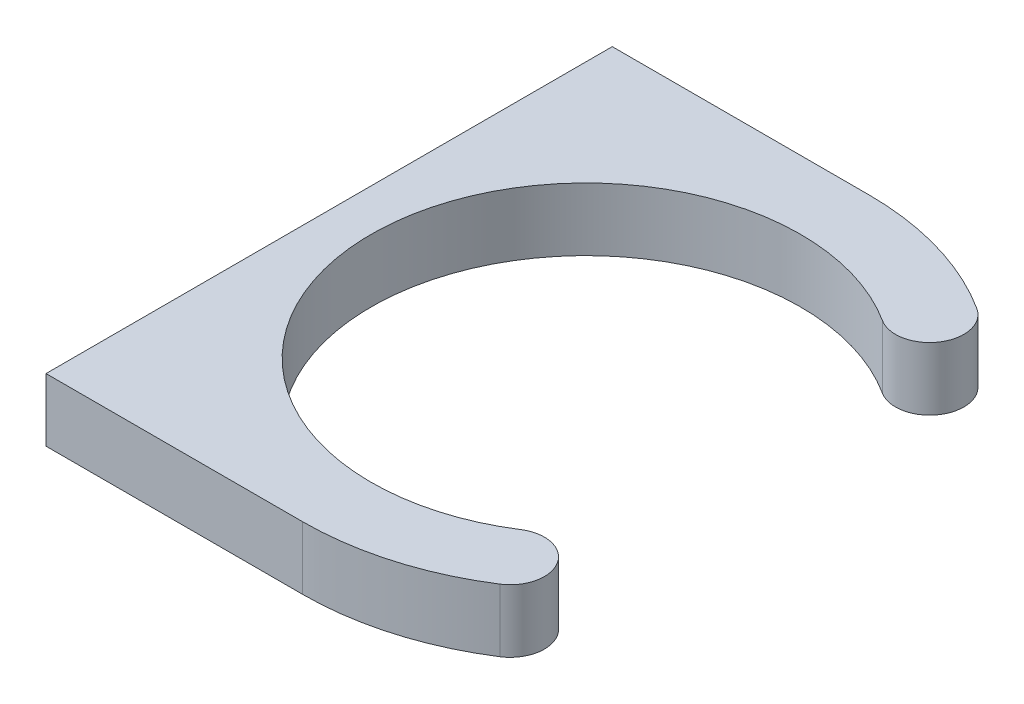
ISO-10303-21;
HEADER;
FILE_DESCRIPTION(('STEP AP214'),'2;1');
FILE_NAME('part.step','',(''),(''),'','','');
FILE_SCHEMA(('AUTOMOTIVE_DESIGN { 1 0 10303 214 1 1 1 1 }'));
ENDSEC;
DATA;
#1=APPLICATION_CONTEXT('core data for automotive mechanical design processes');
#2=APPLICATION_PROTOCOL_DEFINITION('international standard','automotive_design',2000,#1);
#3=PRODUCT_CONTEXT('',#1,'mechanical');
#4=PRODUCT('Part','Part','',(#3));
#5=PRODUCT_RELATED_PRODUCT_CATEGORY('part','',(#4));
#6=PRODUCT_DEFINITION_FORMATION('','',#4);
#7=PRODUCT_DEFINITION_CONTEXT('part definition',#1,'design');
#8=PRODUCT_DEFINITION('design','',#6,#7);
#9=PRODUCT_DEFINITION_SHAPE('','',#8);
#10=(LENGTH_UNIT() NAMED_UNIT(*) SI_UNIT(.MILLI.,.METRE.));
#11=(NAMED_UNIT(*) PLANE_ANGLE_UNIT() SI_UNIT($,.RADIAN.));
#12=(NAMED_UNIT(*) SI_UNIT($,.STERADIAN.) SOLID_ANGLE_UNIT());
#13=UNCERTAINTY_MEASURE_WITH_UNIT(LENGTH_MEASURE(1.E-05),#10,'distance_accuracy_value','');
#14=(GEOMETRIC_REPRESENTATION_CONTEXT(3) GLOBAL_UNCERTAINTY_ASSIGNED_CONTEXT((#13)) GLOBAL_UNIT_ASSIGNED_CONTEXT((#10,
#11,#12)) REPRESENTATION_CONTEXT('',''));
#15=CARTESIAN_POINT('',(0.,0.,0.));
#16=DIRECTION('',(0.,0.,1.));
#17=DIRECTION('',(1.,0.,0.));
#18=AXIS2_PLACEMENT_3D('',#15,#16,#17);
#19=CARTESIAN_POINT('',(0.,4.7625,-42.8625));
#20=DIRECTION('',(0.,0.,1.));
#21=DIRECTION('',(1.,0.,0.));
#22=AXIS2_PLACEMENT_3D('',#19,#20,#21);
#23=PLANE('',#22);
#24=DIRECTION('',(-1.,0.,0.));
#25=VECTOR('',#24,1.);
#26=CARTESIAN_POINT('',(0.,-4.7625,-42.8625));
#27=LINE('',#26,#25);
#28=CARTESIAN_POINT('',(0.,-4.7625,-42.8625));
#29=VERTEX_POINT('',#28);
#30=CARTESIAN_POINT('',(-38.862,-4.7625,-42.8625));
#31=VERTEX_POINT('',#30);
#32=EDGE_CURVE('E130',#29,#31,#27,.T.);
#33=ORIENTED_EDGE('',*,*,#32,.T.);
#34=DIRECTION('',(0.,-1.,0.));
#35=VECTOR('',#34,1.);
#36=CARTESIAN_POINT('',(-38.862,4.7625,-42.8625));
#37=LINE('',#36,#35);
#38=CARTESIAN_POINT('',(-38.862,4.7625,-42.8625));
#39=VERTEX_POINT('',#38);
#40=EDGE_CURVE('E11',#39,#31,#37,.T.);
#41=ORIENTED_EDGE('',*,*,#40,.F.);
#42=DIRECTION('',(-1.,0.,0.));
#43=VECTOR('',#42,1.);
#44=CARTESIAN_POINT('',(0.,4.7625,-42.8625));
#45=LINE('',#44,#43);
#46=CARTESIAN_POINT('',(0.,4.7625,-42.8625));
#47=VERTEX_POINT('',#46);
#48=EDGE_CURVE('E145',#47,#39,#45,.T.);
#49=ORIENTED_EDGE('',*,*,#48,.F.);
#50=DIRECTION('',(0.,-1.,0.));
#51=VECTOR('',#50,1.);
#52=CARTESIAN_POINT('',(0.,4.7625,-42.8625));
#53=LINE('',#52,#51);
#54=EDGE_CURVE('E126',#47,#29,#53,.T.);
#55=ORIENTED_EDGE('',*,*,#54,.T.);
#56=EDGE_LOOP('',(#33,#41,#49,#55));
#57=FACE_BOUND('',#56,.T.);
#58=ADVANCED_FACE('F34',(#57),#23,.F.);
#59=CARTESIAN_POINT('',(-38.862,4.7625,-42.8625));
#60=DIRECTION('',(1.,0.,0.));
#61=DIRECTION('',(0.,0.,-1.));
#62=AXIS2_PLACEMENT_3D('',#59,#60,#61);
#63=PLANE('',#62);
#64=CARTESIAN_POINT('',(-38.862,0.,38.1));
#65=DIRECTION('',(-1.,0.,0.));
#66=DIRECTION('',(0.,0.,1.));
#67=AXIS2_PLACEMENT_3D('',#64,#65,#66);
#68=CIRCLE('',#67,1.3890625);
#69=CARTESIAN_POINT('',(-38.862,0.,39.4890625));
#70=VERTEX_POINT('',#69);
#71=EDGE_CURVE('E184',#70,#70,#68,.T.);
#72=ORIENTED_EDGE('',*,*,#71,.F.);
#73=EDGE_LOOP('',(#72));
#74=FACE_BOUND('',#73,.T.);
#75=CARTESIAN_POINT('',(-38.862,0.,-38.1));
#76=DIRECTION('',(-1.,0.,0.));
#77=DIRECTION('',(0.,0.,1.));
#78=AXIS2_PLACEMENT_3D('',#75,#76,#77);
#79=CIRCLE('',#78,1.3890625);
#80=CARTESIAN_POINT('',(-38.862,0.,-36.7109375));
#81=VERTEX_POINT('',#80);
#82=EDGE_CURVE('E178',#81,#81,#79,.T.);
#83=ORIENTED_EDGE('',*,*,#82,.F.);
#84=EDGE_LOOP('',(#83));
#85=FACE_BOUND('',#84,.T.);
#86=DIRECTION('',(0.,0.,1.));
#87=VECTOR('',#86,1.);
#88=CARTESIAN_POINT('',(-38.862,-4.7625,-42.8625));
#89=LINE('',#88,#87);
#90=CARTESIAN_POINT('',(-38.862,-4.7625,42.8625));
#91=VERTEX_POINT('',#90);
#92=EDGE_CURVE('E133',#31,#91,#89,.T.);
#93=ORIENTED_EDGE('',*,*,#92,.T.);
#94=DIRECTION('',(0.,-1.,0.));
#95=VECTOR('',#94,1.);
#96=CARTESIAN_POINT('',(-38.862,4.7625,42.8625));
#97=LINE('',#96,#95);
#98=CARTESIAN_POINT('',(-38.862,4.7625,42.8625));
#99=VERTEX_POINT('',#98);
#100=EDGE_CURVE('E42',#99,#91,#97,.T.);
#101=ORIENTED_EDGE('',*,*,#100,.F.);
#102=DIRECTION('',(0.,0.,1.));
#103=VECTOR('',#102,1.);
#104=CARTESIAN_POINT('',(-38.862,4.7625,-42.8625));
#105=LINE('',#104,#103);
#106=EDGE_CURVE('E93',#39,#99,#105,.T.);
#107=ORIENTED_EDGE('',*,*,#106,.F.);
#108=ORIENTED_EDGE('',*,*,#40,.T.);
#109=EDGE_LOOP('',(#93,#101,#107,#108));
#110=FACE_BOUND('',#109,.T.);
#111=ADVANCED_FACE('F199',(#74,#85,#110),#63,.F.);
#112=CARTESIAN_POINT('',(0.,4.7625,42.8625));
#113=DIRECTION('',(0.,0.,-1.));
#114=DIRECTION('',(-1.,0.,0.));
#115=AXIS2_PLACEMENT_3D('',#112,#113,#114);
#116=PLANE('',#115);
#117=DIRECTION('',(1.,0.,0.));
#118=VECTOR('',#117,1.);
#119=CARTESIAN_POINT('',(0.,-4.7625,42.8625));
#120=LINE('',#119,#118);
#121=CARTESIAN_POINT('',(0.,-4.7625,42.8625));
#122=VERTEX_POINT('',#121);
#123=EDGE_CURVE('E136',#91,#122,#120,.T.);
#124=ORIENTED_EDGE('',*,*,#123,.T.);
#125=DIRECTION('',(0.,-1.,0.));
#126=VECTOR('',#125,1.);
#127=CARTESIAN_POINT('',(0.,4.7625,42.8625));
#128=LINE('',#127,#126);
#129=CARTESIAN_POINT('',(0.,4.7625,42.8625));
#130=VERTEX_POINT('',#129);
#131=EDGE_CURVE('E152',#130,#122,#128,.T.);
#132=ORIENTED_EDGE('',*,*,#131,.F.);
#133=DIRECTION('',(1.,0.,0.));
#134=VECTOR('',#133,1.);
#135=CARTESIAN_POINT('',(0.,4.7625,42.8625));
#136=LINE('',#135,#134);
#137=EDGE_CURVE('E160',#99,#130,#136,.T.);
#138=ORIENTED_EDGE('',*,*,#137,.F.);
#139=ORIENTED_EDGE('',*,*,#100,.T.);
#140=EDGE_LOOP('',(#124,#132,#138,#139));
#141=FACE_BOUND('',#140,.T.);
#142=ADVANCED_FACE('F158',(#141),#116,.F.);
#143=CARTESIAN_POINT('',(0.,4.7625,0.));
#144=DIRECTION('',(0.,-1.,0.));
#145=DIRECTION('',(0.,0.,-1.));
#146=AXIS2_PLACEMENT_3D('',#143,#144,#145);
#147=CYLINDRICAL_SURFACE('',#146,42.8625);
#148=CARTESIAN_POINT('',(0.,-4.7625,0.));
#149=DIRECTION('',(0.,1.,0.));
#150=DIRECTION('',(0.,0.,1.));
#151=AXIS2_PLACEMENT_3D('',#148,#149,#150);
#152=CIRCLE('',#151,42.8625);
#153=CARTESIAN_POINT('',(23.0925543242562,-4.7625,36.1099410278011));
#154=VERTEX_POINT('',#153);
#155=EDGE_CURVE('E138',#122,#154,#152,.T.);
#156=ORIENTED_EDGE('',*,*,#155,.T.);
#157=DIRECTION('',(0.,-1.,0.));
#158=VECTOR('',#157,1.);
#159=CARTESIAN_POINT('',(23.0925543242562,4.7625,36.1099410278011));
#160=LINE('',#159,#158);
#161=CARTESIAN_POINT('',(23.0925543242562,4.7625,36.1099410278011));
#162=VERTEX_POINT('',#161);
#163=EDGE_CURVE('E149',#162,#154,#160,.T.);
#164=ORIENTED_EDGE('',*,*,#163,.F.);
#165=CARTESIAN_POINT('',(0.,4.7625,0.));
#166=DIRECTION('',(0.,1.,0.));
#167=DIRECTION('',(0.,0.,1.));
#168=AXIS2_PLACEMENT_3D('',#165,#166,#167);
#169=CIRCLE('',#168,42.8625);
#170=EDGE_CURVE('E172',#130,#162,#169,.T.);
#171=ORIENTED_EDGE('',*,*,#170,.F.);
#172=ORIENTED_EDGE('',*,*,#131,.T.);
#173=EDGE_LOOP('',(#156,#164,#171,#172));
#174=FACE_BOUND('',#173,.T.);
#175=ADVANCED_FACE('F168',(#174),#147,.T.);
#176=CARTESIAN_POINT('',(20.3043422095497,4.7625,31.75));
#177=DIRECTION('',(0.,-1.,0.));
#178=DIRECTION('',(0.,0.,-1.));
#179=AXIS2_PLACEMENT_3D('',#176,#177,#178);
#180=CYLINDRICAL_SURFACE('',#179,5.17524999999999);
#181=CARTESIAN_POINT('',(20.3043422095497,-4.7625,31.75));
#182=DIRECTION('',(0.,1.,0.));
#183=DIRECTION('',(0.,0.,-1.));
#184=AXIS2_PLACEMENT_3D('',#181,#182,#183);
#185=CIRCLE('',#184,5.17524999999999);
#186=CARTESIAN_POINT('',(17.5161300948433,-4.7625,27.3900589721988));
#187=VERTEX_POINT('',#186);
#188=EDGE_CURVE('E140',#154,#187,#185,.T.);
#189=ORIENTED_EDGE('',*,*,#188,.T.);
#190=DIRECTION('',(0.,-1.,0.));
#191=VECTOR('',#190,1.);
#192=CARTESIAN_POINT('',(17.5161300948433,4.7625,27.3900589721988));
#193=LINE('',#192,#191);
#194=CARTESIAN_POINT('',(17.5161300948433,4.7625,27.3900589721988));
#195=VERTEX_POINT('',#194);
#196=EDGE_CURVE('E121',#195,#187,#193,.T.);
#197=ORIENTED_EDGE('',*,*,#196,.F.);
#198=CARTESIAN_POINT('',(20.3043422095497,4.7625,31.75));
#199=DIRECTION('',(0.,1.,0.));
#200=DIRECTION('',(0.,0.,-1.));
#201=AXIS2_PLACEMENT_3D('',#198,#199,#200);
#202=CIRCLE('',#201,5.17524999999999);
#203=EDGE_CURVE('E112',#162,#195,#202,.T.);
#204=ORIENTED_EDGE('',*,*,#203,.F.);
#205=ORIENTED_EDGE('',*,*,#163,.T.);
#206=EDGE_LOOP('',(#189,#197,#204,#205));
#207=FACE_BOUND('',#206,.T.);
#208=ADVANCED_FACE('F171',(#207),#180,.T.);
#209=CARTESIAN_POINT('',(0.,4.7625,0.));
#210=DIRECTION('',(0.,-1.,0.));
#211=DIRECTION('',(0.,0.,-1.));
#212=AXIS2_PLACEMENT_3D('',#209,#210,#211);
#213=CYLINDRICAL_SURFACE('',#212,32.512);
#214=CARTESIAN_POINT('',(0.,-4.7625,0.));
#215=DIRECTION('',(0.,-1.,0.));
#216=DIRECTION('',(0.,0.,1.));
#217=AXIS2_PLACEMENT_3D('',#214,#215,#216);
#218=CIRCLE('',#217,32.512);
#219=CARTESIAN_POINT('',(17.5161300948432,-4.7625,-27.3900589721988));
#220=VERTEX_POINT('',#219);
#221=EDGE_CURVE('E120',#187,#220,#218,.T.);
#222=ORIENTED_EDGE('',*,*,#221,.T.);
#223=DIRECTION('',(0.,-1.,0.));
#224=VECTOR('',#223,1.);
#225=CARTESIAN_POINT('',(17.5161300948432,4.7625,-27.3900589721988));
#226=LINE('',#225,#224);
#227=CARTESIAN_POINT('',(17.5161300948432,4.7625,-27.3900589721988));
#228=VERTEX_POINT('',#227);
#229=EDGE_CURVE('E117',#228,#220,#226,.T.);
#230=ORIENTED_EDGE('',*,*,#229,.F.);
#231=CARTESIAN_POINT('',(0.,4.7625,0.));
#232=DIRECTION('',(0.,-1.,0.));
#233=DIRECTION('',(0.,0.,1.));
#234=AXIS2_PLACEMENT_3D('',#231,#232,#233);
#235=CIRCLE('',#234,32.512);
#236=EDGE_CURVE('E106',#195,#228,#235,.T.);
#237=ORIENTED_EDGE('',*,*,#236,.F.);
#238=ORIENTED_EDGE('',*,*,#196,.T.);
#239=EDGE_LOOP('',(#222,#230,#237,#238));
#240=FACE_BOUND('',#239,.T.);
#241=ADVANCED_FACE('F118',(#240),#213,.F.);
#242=CARTESIAN_POINT('',(20.3043422095497,4.7625,-31.75));
#243=DIRECTION('',(0.,-1.,0.));
#244=DIRECTION('',(0.,0.,-1.));
#245=AXIS2_PLACEMENT_3D('',#242,#243,#244);
#246=CYLINDRICAL_SURFACE('',#245,5.17524999999999);
#247=CARTESIAN_POINT('',(20.3043422095497,-4.7625,-31.75));
#248=DIRECTION('',(0.,1.,0.));
#249=DIRECTION('',(0.,0.,1.));
#250=AXIS2_PLACEMENT_3D('',#247,#248,#249);
#251=CIRCLE('',#250,5.17524999999999);
#252=CARTESIAN_POINT('',(23.0925543242562,-4.7625,-36.1099410278012));
#253=VERTEX_POINT('',#252);
#254=EDGE_CURVE('E79',#220,#253,#251,.T.);
#255=ORIENTED_EDGE('',*,*,#254,.T.);
#256=DIRECTION('',(0.,-1.,0.));
#257=VECTOR('',#256,1.);
#258=CARTESIAN_POINT('',(23.0925543242562,4.7625,-36.1099410278012));
#259=LINE('',#258,#257);
#260=CARTESIAN_POINT('',(23.0925543242562,4.7625,-36.1099410278012));
#261=VERTEX_POINT('',#260);
#262=EDGE_CURVE('E122',#261,#253,#259,.T.);
#263=ORIENTED_EDGE('',*,*,#262,.F.);
#264=CARTESIAN_POINT('',(20.3043422095497,4.7625,-31.75));
#265=DIRECTION('',(0.,1.,0.));
#266=DIRECTION('',(0.,0.,1.));
#267=AXIS2_PLACEMENT_3D('',#264,#265,#266);
#268=CIRCLE('',#267,5.17524999999999);
#269=EDGE_CURVE('E110',#228,#261,#268,.T.);
#270=ORIENTED_EDGE('',*,*,#269,.F.);
#271=ORIENTED_EDGE('',*,*,#229,.T.);
#272=EDGE_LOOP('',(#255,#263,#270,#271));
#273=FACE_BOUND('',#272,.T.);
#274=ADVANCED_FACE('F124',(#273),#246,.T.);
#275=CARTESIAN_POINT('',(0.,4.7625,0.));
#276=DIRECTION('',(0.,-1.,0.));
#277=DIRECTION('',(0.,0.,-1.));
#278=AXIS2_PLACEMENT_3D('',#275,#276,#277);
#279=CYLINDRICAL_SURFACE('',#278,42.8625);
#280=CARTESIAN_POINT('',(0.,-4.7625,0.));
#281=DIRECTION('',(0.,1.,0.));
#282=DIRECTION('',(0.,0.,1.));
#283=AXIS2_PLACEMENT_3D('',#280,#281,#282);
#284=CIRCLE('',#283,42.8625);
#285=EDGE_CURVE('E85',#253,#29,#284,.T.);
#286=ORIENTED_EDGE('',*,*,#285,.T.);
#287=ORIENTED_EDGE('',*,*,#54,.F.);
#288=CARTESIAN_POINT('',(0.,4.7625,0.));
#289=DIRECTION('',(0.,1.,0.));
#290=DIRECTION('',(0.,0.,1.));
#291=AXIS2_PLACEMENT_3D('',#288,#289,#290);
#292=CIRCLE('',#291,42.8625);
#293=EDGE_CURVE('E50',#261,#47,#292,.T.);
#294=ORIENTED_EDGE('',*,*,#293,.F.);
#295=ORIENTED_EDGE('',*,*,#262,.T.);
#296=EDGE_LOOP('',(#286,#287,#294,#295));
#297=FACE_BOUND('',#296,.T.);
#298=ADVANCED_FACE('F206',(#297),#279,.T.);
#299=CARTESIAN_POINT('',(0.,4.7625,0.));
#300=DIRECTION('',(0.,1.,0.));
#301=DIRECTION('',(0.,0.,1.));
#302=AXIS2_PLACEMENT_3D('',#299,#300,#301);
#303=PLANE('',#302);
#304=ORIENTED_EDGE('',*,*,#48,.T.);
#305=ORIENTED_EDGE('',*,*,#106,.T.);
#306=ORIENTED_EDGE('',*,*,#137,.T.);
#307=ORIENTED_EDGE('',*,*,#170,.T.);
#308=ORIENTED_EDGE('',*,*,#203,.T.);
#309=ORIENTED_EDGE('',*,*,#236,.T.);
#310=ORIENTED_EDGE('',*,*,#269,.T.);
#311=ORIENTED_EDGE('',*,*,#293,.T.);
#312=EDGE_LOOP('',(#304,#305,#306,#307,#308,#309,#310,#311));
#313=FACE_BOUND('',#312,.T.);
#314=ADVANCED_FACE('F108',(#313),#303,.T.);
#315=CARTESIAN_POINT('',(0.,-4.7625,0.));
#316=DIRECTION('',(0.,1.,0.));
#317=DIRECTION('',(0.,0.,1.));
#318=AXIS2_PLACEMENT_3D('',#315,#316,#317);
#319=PLANE('',#318);
#320=ORIENTED_EDGE('',*,*,#32,.F.);
#321=ORIENTED_EDGE('',*,*,#285,.F.);
#322=ORIENTED_EDGE('',*,*,#254,.F.);
#323=ORIENTED_EDGE('',*,*,#221,.F.);
#324=ORIENTED_EDGE('',*,*,#188,.F.);
#325=ORIENTED_EDGE('',*,*,#155,.F.);
#326=ORIENTED_EDGE('',*,*,#123,.F.);
#327=ORIENTED_EDGE('',*,*,#92,.F.);
#328=EDGE_LOOP('',(#320,#321,#322,#323,#324,#325,#326,#327));
#329=FACE_BOUND('',#328,.T.);
#330=ADVANCED_FACE('F164',(#329),#319,.F.);
#331=CARTESIAN_POINT('',(-13.462,0.,-38.1));
#332=DIRECTION('',(-1.,0.,0.));
#333=DIRECTION('',(0.,0.,1.));
#334=AXIS2_PLACEMENT_3D('',#331,#332,#333);
#335=CYLINDRICAL_SURFACE('',#334,1.3890625);
#336=CARTESIAN_POINT('',(-13.462,0.,-38.1));
#337=DIRECTION('',(-1.,0.,0.));
#338=DIRECTION('',(0.,0.,1.));
#339=AXIS2_PLACEMENT_3D('',#336,#337,#338);
#340=CIRCLE('',#339,1.3890625);
#341=CARTESIAN_POINT('',(-13.462,0.,-36.7109375));
#342=VERTEX_POINT('',#341);
#343=EDGE_CURVE('E134',#342,#342,#340,.T.);
#344=ORIENTED_EDGE('',*,*,#343,.F.);
#345=EDGE_LOOP('',(#344));
#346=FACE_BOUND('',#345,.T.);
#347=ORIENTED_EDGE('',*,*,#82,.T.);
#348=EDGE_LOOP('',(#347));
#349=FACE_BOUND('',#348,.T.);
#350=ADVANCED_FACE('F271',(#346,#349),#335,.F.);
#351=CARTESIAN_POINT('',(-13.462,0.,-38.1));
#352=DIRECTION('',(-1.,0.,0.));
#353=DIRECTION('',(0.,0.,1.));
#354=AXIS2_PLACEMENT_3D('',#351,#352,#353);
#355=PLANE('',#354);
#356=ORIENTED_EDGE('',*,*,#343,.T.);
#357=EDGE_LOOP('',(#356));
#358=FACE_BOUND('',#357,.T.);
#359=ADVANCED_FACE('F195',(#358),#355,.T.);
#360=CARTESIAN_POINT('',(-13.462,0.,38.1));
#361=DIRECTION('',(-1.,0.,0.));
#362=DIRECTION('',(0.,0.,1.));
#363=AXIS2_PLACEMENT_3D('',#360,#361,#362);
#364=CYLINDRICAL_SURFACE('',#363,1.3890625);
#365=CARTESIAN_POINT('',(-13.462,0.,38.1));
#366=DIRECTION('',(-1.,0.,0.));
#367=DIRECTION('',(0.,0.,1.));
#368=AXIS2_PLACEMENT_3D('',#365,#366,#367);
#369=CIRCLE('',#368,1.3890625);
#370=CARTESIAN_POINT('',(-13.462,0.,39.4890625));
#371=VERTEX_POINT('',#370);
#372=EDGE_CURVE('E181',#371,#371,#369,.T.);
#373=ORIENTED_EDGE('',*,*,#372,.F.);
#374=EDGE_LOOP('',(#373));
#375=FACE_BOUND('',#374,.T.);
#376=ORIENTED_EDGE('',*,*,#71,.T.);
#377=EDGE_LOOP('',(#376));
#378=FACE_BOUND('',#377,.T.);
#379=ADVANCED_FACE('F192',(#375,#378),#364,.F.);
#380=CARTESIAN_POINT('',(-13.462,0.,38.1));
#381=DIRECTION('',(-1.,0.,0.));
#382=DIRECTION('',(0.,0.,1.));
#383=AXIS2_PLACEMENT_3D('',#380,#381,#382);
#384=PLANE('',#383);
#385=ORIENTED_EDGE('',*,*,#372,.T.);
#386=EDGE_LOOP('',(#385));
#387=FACE_BOUND('',#386,.T.);
#388=ADVANCED_FACE('F190',(#387),#384,.T.);
#389=CLOSED_SHELL('',(#58,#111,#142,#175,#208,#241,#274,#298,#314,#330,#350,#359,#379,#388));
#390=MANIFOLD_SOLID_BREP('B2',#389);
#391=ADVANCED_BREP_SHAPE_REPRESENTATION('',(#18,#390),#14);
#392=SHAPE_DEFINITION_REPRESENTATION(#9,#391);
ENDSEC;
END-ISO-10303-21;
